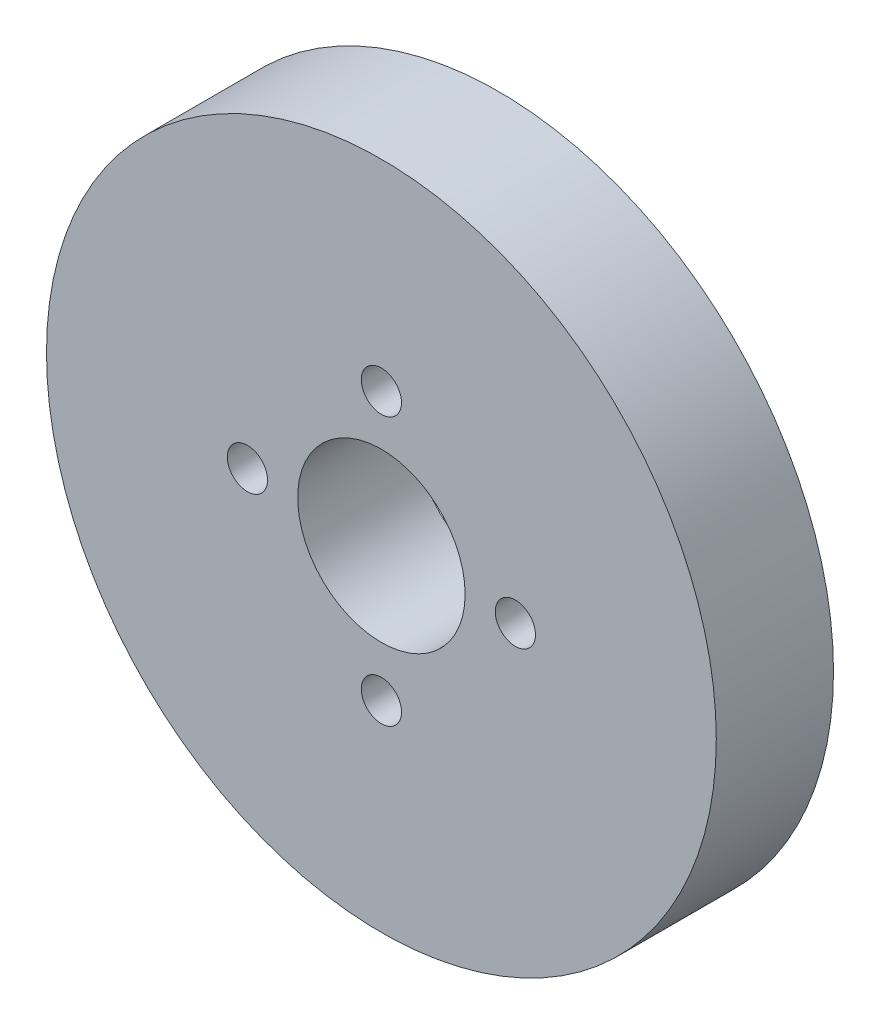
ISO-10303-21;
HEADER;
FILE_DESCRIPTION(('STEP AP214'),'2;1');
FILE_NAME('part.step','',(''),(''),'','','');
FILE_SCHEMA(('AUTOMOTIVE_DESIGN { 1 0 10303 214 1 1 1 1 }'));
ENDSEC;
DATA;
#1=APPLICATION_CONTEXT('core data for automotive mechanical design processes');
#2=APPLICATION_PROTOCOL_DEFINITION('international standard','automotive_design',2000,#1);
#3=PRODUCT_CONTEXT('',#1,'mechanical');
#4=PRODUCT('Part','Part','',(#3));
#5=PRODUCT_RELATED_PRODUCT_CATEGORY('part','',(#4));
#6=PRODUCT_DEFINITION_FORMATION('','',#4);
#7=PRODUCT_DEFINITION_CONTEXT('part definition',#1,'design');
#8=PRODUCT_DEFINITION('design','',#6,#7);
#9=PRODUCT_DEFINITION_SHAPE('','',#8);
#10=(LENGTH_UNIT() NAMED_UNIT(*) SI_UNIT(.MILLI.,.METRE.));
#11=(NAMED_UNIT(*) PLANE_ANGLE_UNIT() SI_UNIT($,.RADIAN.));
#12=(NAMED_UNIT(*) SI_UNIT($,.STERADIAN.) SOLID_ANGLE_UNIT());
#13=UNCERTAINTY_MEASURE_WITH_UNIT(LENGTH_MEASURE(1.E-05),#10,'distance_accuracy_value','');
#14=(GEOMETRIC_REPRESENTATION_CONTEXT(3) GLOBAL_UNCERTAINTY_ASSIGNED_CONTEXT((#13)) GLOBAL_UNIT_ASSIGNED_CONTEXT((#10,
#11,#12)) REPRESENTATION_CONTEXT('',''));
#15=CARTESIAN_POINT('',(0.,0.,0.));
#16=DIRECTION('',(0.,0.,1.));
#17=DIRECTION('',(1.,0.,0.));
#18=AXIS2_PLACEMENT_3D('',#15,#16,#17);
#19=CARTESIAN_POINT('',(0.,0.,7.));
#20=DIRECTION('',(0.,0.,1.));
#21=DIRECTION('',(1.,0.,0.));
#22=AXIS2_PLACEMENT_3D('',#19,#20,#21);
#23=PLANE('',#22);
#24=CARTESIAN_POINT('',(0.,8.,7.));
#25=DIRECTION('',(0.,0.,1.));
#26=DIRECTION('',(1.,0.,0.));
#27=AXIS2_PLACEMENT_3D('',#24,#25,#26);
#28=CIRCLE('',#27,1.19999999999999);
#29=CARTESIAN_POINT('',(1.19999999999999,8.,7.));
#30=VERTEX_POINT('',#29);
#31=EDGE_CURVE('E74',#30,#30,#28,.T.);
#32=ORIENTED_EDGE('',*,*,#31,.F.);
#33=EDGE_LOOP('',(#32));
#34=FACE_BOUND('',#33,.T.);
#35=CARTESIAN_POINT('',(8.00000000000023,2.26393958003914E-13,7.));
#36=DIRECTION('',(0.,0.,1.));
#37=DIRECTION('',(1.,0.,0.));
#38=AXIS2_PLACEMENT_3D('',#35,#36,#37);
#39=CIRCLE('',#38,1.19999999999999);
#40=CARTESIAN_POINT('',(9.20000000000021,2.26393958003914E-13,7.));
#41=VERTEX_POINT('',#40);
#42=EDGE_CURVE('E68',#41,#41,#39,.T.);
#43=ORIENTED_EDGE('',*,*,#42,.F.);
#44=EDGE_LOOP('',(#43));
#45=FACE_BOUND('',#44,.T.);
#46=CARTESIAN_POINT('',(4.52787916007828E-13,-8.,7.));
#47=DIRECTION('',(0.,0.,1.));
#48=DIRECTION('',(1.,0.,0.));
#49=AXIS2_PLACEMENT_3D('',#46,#47,#48);
#50=CIRCLE('',#49,1.19999999999999);
#51=CARTESIAN_POINT('',(1.20000000000044,-8.,7.));
#52=VERTEX_POINT('',#51);
#53=EDGE_CURVE('E62',#52,#52,#50,.T.);
#54=ORIENTED_EDGE('',*,*,#53,.F.);
#55=EDGE_LOOP('',(#54));
#56=FACE_BOUND('',#55,.T.);
#57=CARTESIAN_POINT('',(-7.99999999999977,-2.25414240564596E-13,7.));
#58=DIRECTION('',(0.,0.,1.));
#59=DIRECTION('',(1.,0.,0.));
#60=AXIS2_PLACEMENT_3D('',#57,#58,#59);
#61=CIRCLE('',#60,1.19999999999999);
#62=CARTESIAN_POINT('',(-6.79999999999979,-2.25414240564596E-13,7.));
#63=VERTEX_POINT('',#62);
#64=EDGE_CURVE('E56',#63,#63,#61,.T.);
#65=ORIENTED_EDGE('',*,*,#64,.F.);
#66=EDGE_LOOP('',(#65));
#67=FACE_BOUND('',#66,.T.);
#68=CARTESIAN_POINT('',(0.,0.,7.));
#69=DIRECTION('',(0.,0.,1.));
#70=DIRECTION('',(1.,0.,0.));
#71=AXIS2_PLACEMENT_3D('',#68,#69,#70);
#72=CIRCLE('',#71,20.);
#73=CARTESIAN_POINT('',(20.,0.,7.));
#74=VERTEX_POINT('',#73);
#75=EDGE_CURVE('E10',#74,#74,#72,.T.);
#76=ORIENTED_EDGE('',*,*,#75,.T.);
#77=EDGE_LOOP('',(#76));
#78=FACE_BOUND('',#77,.T.);
#79=CARTESIAN_POINT('',(0.,0.,7.));
#80=DIRECTION('',(0.,0.,1.));
#81=DIRECTION('',(1.,0.,0.));
#82=AXIS2_PLACEMENT_3D('',#79,#80,#81);
#83=CIRCLE('',#82,5.);
#84=CARTESIAN_POINT('',(5.,0.,7.));
#85=VERTEX_POINT('',#84);
#86=EDGE_CURVE('E46',#85,#85,#83,.T.);
#87=ORIENTED_EDGE('',*,*,#86,.F.);
#88=EDGE_LOOP('',(#87));
#89=FACE_BOUND('',#88,.T.);
#90=ADVANCED_FACE('F35',(#34,#45,#56,#67,#78,#89),#23,.T.);
#91=CARTESIAN_POINT('',(0.,0.,0.));
#92=DIRECTION('',(0.,0.,1.));
#93=DIRECTION('',(1.,0.,0.));
#94=AXIS2_PLACEMENT_3D('',#91,#92,#93);
#95=PLANE('',#94);
#96=CARTESIAN_POINT('',(0.,8.,0.));
#97=DIRECTION('',(0.,0.,1.));
#98=DIRECTION('',(1.,0.,0.));
#99=AXIS2_PLACEMENT_3D('',#96,#97,#98);
#100=CIRCLE('',#99,1.2);
#101=CARTESIAN_POINT('',(1.2,8.,0.));
#102=VERTEX_POINT('',#101);
#103=EDGE_CURVE('E71',#102,#102,#100,.T.);
#104=ORIENTED_EDGE('',*,*,#103,.T.);
#105=EDGE_LOOP('',(#104));
#106=FACE_BOUND('',#105,.T.);
#107=CARTESIAN_POINT('',(8.00000000000023,2.26393958003914E-13,0.));
#108=DIRECTION('',(0.,0.,1.));
#109=DIRECTION('',(1.,0.,0.));
#110=AXIS2_PLACEMENT_3D('',#107,#108,#109);
#111=CIRCLE('',#110,1.2);
#112=CARTESIAN_POINT('',(9.20000000000022,2.26393958003914E-13,0.));
#113=VERTEX_POINT('',#112);
#114=EDGE_CURVE('E65',#113,#113,#111,.T.);
#115=ORIENTED_EDGE('',*,*,#114,.T.);
#116=EDGE_LOOP('',(#115));
#117=FACE_BOUND('',#116,.T.);
#118=CARTESIAN_POINT('',(4.52787916007828E-13,-8.,0.));
#119=DIRECTION('',(0.,0.,1.));
#120=DIRECTION('',(1.,0.,0.));
#121=AXIS2_PLACEMENT_3D('',#118,#119,#120);
#122=CIRCLE('',#121,1.2);
#123=CARTESIAN_POINT('',(1.20000000000045,-8.,0.));
#124=VERTEX_POINT('',#123);
#125=EDGE_CURVE('E59',#124,#124,#122,.T.);
#126=ORIENTED_EDGE('',*,*,#125,.T.);
#127=EDGE_LOOP('',(#126));
#128=FACE_BOUND('',#127,.T.);
#129=CARTESIAN_POINT('',(-7.99999999999977,-2.25414240564596E-13,0.));
#130=DIRECTION('',(0.,0.,1.));
#131=DIRECTION('',(1.,0.,0.));
#132=AXIS2_PLACEMENT_3D('',#129,#130,#131);
#133=CIRCLE('',#132,1.2);
#134=CARTESIAN_POINT('',(-6.79999999999978,-2.25414240564596E-13,0.));
#135=VERTEX_POINT('',#134);
#136=EDGE_CURVE('E51',#135,#135,#133,.T.);
#137=ORIENTED_EDGE('',*,*,#136,.T.);
#138=EDGE_LOOP('',(#137));
#139=FACE_BOUND('',#138,.T.);
#140=CARTESIAN_POINT('',(0.,0.,0.));
#141=DIRECTION('',(0.,0.,1.));
#142=DIRECTION('',(1.,0.,0.));
#143=AXIS2_PLACEMENT_3D('',#140,#141,#142);
#144=CIRCLE('',#143,20.);
#145=CARTESIAN_POINT('',(20.,0.,0.));
#146=VERTEX_POINT('',#145);
#147=EDGE_CURVE('E39',#146,#146,#144,.T.);
#148=ORIENTED_EDGE('',*,*,#147,.F.);
#149=EDGE_LOOP('',(#148));
#150=FACE_BOUND('',#149,.T.);
#151=CARTESIAN_POINT('',(0.,0.,0.));
#152=DIRECTION('',(0.,0.,1.));
#153=DIRECTION('',(1.,0.,0.));
#154=AXIS2_PLACEMENT_3D('',#151,#152,#153);
#155=CIRCLE('',#154,5.);
#156=CARTESIAN_POINT('',(5.,0.,0.));
#157=VERTEX_POINT('',#156);
#158=EDGE_CURVE('E48',#157,#157,#155,.T.);
#159=ORIENTED_EDGE('',*,*,#158,.T.);
#160=EDGE_LOOP('',(#159));
#161=FACE_BOUND('',#160,.T.);
#162=ADVANCED_FACE('F82',(#106,#117,#128,#139,#150,#161),#95,.F.);
#163=CARTESIAN_POINT('',(0.,0.,7.));
#164=DIRECTION('',(0.,0.,-1.));
#165=DIRECTION('',(-1.,0.,0.));
#166=AXIS2_PLACEMENT_3D('',#163,#164,#165);
#167=CYLINDRICAL_SURFACE('',#166,20.);
#168=ORIENTED_EDGE('',*,*,#75,.F.);
#169=EDGE_LOOP('',(#168));
#170=FACE_BOUND('',#169,.T.);
#171=ORIENTED_EDGE('',*,*,#147,.T.);
#172=EDGE_LOOP('',(#171));
#173=FACE_BOUND('',#172,.T.);
#174=ADVANCED_FACE('F37',(#170,#173),#167,.T.);
#175=CARTESIAN_POINT('',(0.,0.,7.));
#176=DIRECTION('',(0.,0.,-1.));
#177=DIRECTION('',(-1.,0.,0.));
#178=AXIS2_PLACEMENT_3D('',#175,#176,#177);
#179=CYLINDRICAL_SURFACE('',#178,5.);
#180=ORIENTED_EDGE('',*,*,#86,.T.);
#181=EDGE_LOOP('',(#180));
#182=FACE_BOUND('',#181,.T.);
#183=ORIENTED_EDGE('',*,*,#158,.F.);
#184=EDGE_LOOP('',(#183));
#185=FACE_BOUND('',#184,.T.);
#186=ADVANCED_FACE('F92',(#182,#185),#179,.F.);
#187=CARTESIAN_POINT('',(-7.99999999999977,-2.25414240564596E-13,7.));
#188=DIRECTION('',(0.,0.,1.));
#189=DIRECTION('',(1.,0.,0.));
#190=AXIS2_PLACEMENT_3D('',#187,#188,#189);
#191=CYLINDRICAL_SURFACE('',#190,1.19999999999999);
#192=ORIENTED_EDGE('',*,*,#136,.F.);
#193=EDGE_LOOP('',(#192));
#194=FACE_BOUND('',#193,.T.);
#195=ORIENTED_EDGE('',*,*,#64,.T.);
#196=EDGE_LOOP('',(#195));
#197=FACE_BOUND('',#196,.T.);
#198=ADVANCED_FACE('F95',(#194,#197),#191,.F.);
#199=CARTESIAN_POINT('',(4.52787916007828E-13,-8.,7.));
#200=DIRECTION('',(0.,0.,1.));
#201=DIRECTION('',(1.,0.,0.));
#202=AXIS2_PLACEMENT_3D('',#199,#200,#201);
#203=CYLINDRICAL_SURFACE('',#202,1.19999999999999);
#204=ORIENTED_EDGE('',*,*,#125,.F.);
#205=EDGE_LOOP('',(#204));
#206=FACE_BOUND('',#205,.T.);
#207=ORIENTED_EDGE('',*,*,#53,.T.);
#208=EDGE_LOOP('',(#207));
#209=FACE_BOUND('',#208,.T.);
#210=ADVANCED_FACE('F109',(#206,#209),#203,.F.);
#211=CARTESIAN_POINT('',(8.00000000000023,2.26393958003914E-13,7.));
#212=DIRECTION('',(0.,0.,1.));
#213=DIRECTION('',(1.,0.,0.));
#214=AXIS2_PLACEMENT_3D('',#211,#212,#213);
#215=CYLINDRICAL_SURFACE('',#214,1.19999999999999);
#216=ORIENTED_EDGE('',*,*,#114,.F.);
#217=EDGE_LOOP('',(#216));
#218=FACE_BOUND('',#217,.T.);
#219=ORIENTED_EDGE('',*,*,#42,.T.);
#220=EDGE_LOOP('',(#219));
#221=FACE_BOUND('',#220,.T.);
#222=ADVANCED_FACE('F113',(#218,#221),#215,.F.);
#223=CARTESIAN_POINT('',(0.,8.,7.));
#224=DIRECTION('',(0.,0.,1.));
#225=DIRECTION('',(1.,0.,0.));
#226=AXIS2_PLACEMENT_3D('',#223,#224,#225);
#227=CYLINDRICAL_SURFACE('',#226,1.19999999999999);
#228=ORIENTED_EDGE('',*,*,#103,.F.);
#229=EDGE_LOOP('',(#228));
#230=FACE_BOUND('',#229,.T.);
#231=ORIENTED_EDGE('',*,*,#31,.T.);
#232=EDGE_LOOP('',(#231));
#233=FACE_BOUND('',#232,.T.);
#234=ADVANCED_FACE('F78',(#230,#233),#227,.F.);
#235=CLOSED_SHELL('',(#90,#162,#174,#186,#198,#210,#222,#234));
#236=MANIFOLD_SOLID_BREP('B2',#235);
#237=ADVANCED_BREP_SHAPE_REPRESENTATION('',(#18,#236),#14);
#238=SHAPE_DEFINITION_REPRESENTATION(#9,#237);
ENDSEC;
END-ISO-10303-21;
